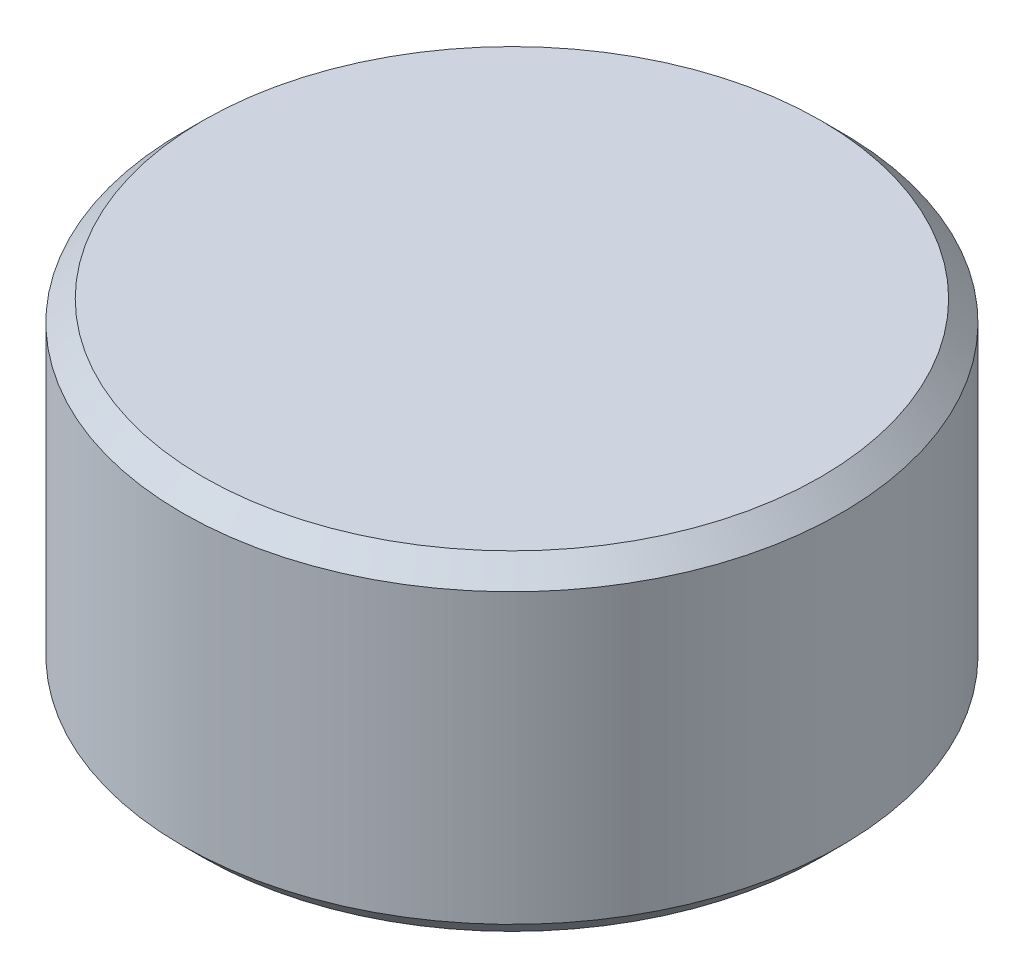
ISO-10303-21;
HEADER;
FILE_DESCRIPTION(('STEP AP214'),'2;1');
FILE_NAME('part.step','',(''),(''),'','','');
FILE_SCHEMA(('AUTOMOTIVE_DESIGN { 1 0 10303 214 1 1 1 1 }'));
ENDSEC;
DATA;
#1=APPLICATION_CONTEXT('core data for automotive mechanical design processes');
#2=APPLICATION_PROTOCOL_DEFINITION('international standard','automotive_design',2000,#1);
#3=PRODUCT_CONTEXT('',#1,'mechanical');
#4=PRODUCT('Part','Part','',(#3));
#5=PRODUCT_RELATED_PRODUCT_CATEGORY('part','',(#4));
#6=PRODUCT_DEFINITION_FORMATION('','',#4);
#7=PRODUCT_DEFINITION_CONTEXT('part definition',#1,'design');
#8=PRODUCT_DEFINITION('design','',#6,#7);
#9=PRODUCT_DEFINITION_SHAPE('','',#8);
#10=(LENGTH_UNIT() NAMED_UNIT(*) SI_UNIT(.MILLI.,.METRE.));
#11=(NAMED_UNIT(*) PLANE_ANGLE_UNIT() SI_UNIT($,.RADIAN.));
#12=(NAMED_UNIT(*) SI_UNIT($,.STERADIAN.) SOLID_ANGLE_UNIT());
#13=UNCERTAINTY_MEASURE_WITH_UNIT(LENGTH_MEASURE(1.E-05),#10,'distance_accuracy_value','');
#14=(GEOMETRIC_REPRESENTATION_CONTEXT(3) GLOBAL_UNCERTAINTY_ASSIGNED_CONTEXT((#13)) GLOBAL_UNIT_ASSIGNED_CONTEXT((#10,
#11,#12)) REPRESENTATION_CONTEXT('',''));
#15=CARTESIAN_POINT('',(0.,0.,0.));
#16=DIRECTION('',(0.,0.,1.));
#17=DIRECTION('',(1.,0.,0.));
#18=AXIS2_PLACEMENT_3D('',#15,#16,#17);
#19=CARTESIAN_POINT('',(0.,0.79375,0.));
#20=DIRECTION('',(0.,-1.,0.));
#21=DIRECTION('',(0.,0.,-1.));
#22=AXIS2_PLACEMENT_3D('',#19,#20,#21);
#23=CYLINDRICAL_SURFACE('',#22,1.5875);
#24=CARTESIAN_POINT('',(0.,-0.693749999999999,0.));
#25=DIRECTION('',(0.,1.,0.));
#26=DIRECTION('',(0.,0.,1.));
#27=AXIS2_PLACEMENT_3D('',#24,#25,#26);
#28=CIRCLE('',#27,1.5875);
#29=CARTESIAN_POINT('',(0.,-0.693749999999999,1.5875));
#30=VERTEX_POINT('',#29);
#31=EDGE_CURVE('E57',#30,#30,#28,.T.);
#32=ORIENTED_EDGE('',*,*,#31,.T.);
#33=EDGE_LOOP('',(#32));
#34=FACE_BOUND('',#33,.T.);
#35=CARTESIAN_POINT('',(0.,0.69375,0.));
#36=DIRECTION('',(0.,1.,0.));
#37=DIRECTION('',(0.,0.,1.));
#38=AXIS2_PLACEMENT_3D('',#35,#36,#37);
#39=CIRCLE('',#38,1.5875);
#40=CARTESIAN_POINT('',(0.,0.69375,1.5875));
#41=VERTEX_POINT('',#40);
#42=EDGE_CURVE('E62',#41,#41,#39,.F.);
#43=ORIENTED_EDGE('',*,*,#42,.T.);
#44=EDGE_LOOP('',(#43));
#45=FACE_BOUND('',#44,.T.);
#46=ADVANCED_FACE('F43',(#34,#45),#23,.T.);
#47=CARTESIAN_POINT('',(0.,0.79375,0.));
#48=DIRECTION('',(0.,1.,0.));
#49=DIRECTION('',(0.,0.,1.));
#50=AXIS2_PLACEMENT_3D('',#47,#48,#49);
#51=PLANE('',#50);
#52=CARTESIAN_POINT('',(0.,0.79375,0.));
#53=DIRECTION('',(0.,1.,0.));
#54=DIRECTION('',(0.,0.,1.));
#55=AXIS2_PLACEMENT_3D('',#52,#53,#54);
#56=CIRCLE('',#55,1.4875);
#57=CARTESIAN_POINT('',(0.,0.79375,1.4875));
#58=VERTEX_POINT('',#57);
#59=EDGE_CURVE('E10',#58,#58,#56,.T.);
#60=ORIENTED_EDGE('',*,*,#59,.T.);
#61=EDGE_LOOP('',(#60));
#62=FACE_BOUND('',#61,.T.);
#63=ADVANCED_FACE('F79',(#62),#51,.T.);
#64=CARTESIAN_POINT('',(0.,-0.79375,0.));
#65=DIRECTION('',(0.,1.,0.));
#66=DIRECTION('',(0.,0.,1.));
#67=AXIS2_PLACEMENT_3D('',#64,#65,#66);
#68=PLANE('',#67);
#69=CARTESIAN_POINT('',(0.,-0.79375,0.));
#70=DIRECTION('',(0.,1.,0.));
#71=DIRECTION('',(0.,0.,1.));
#72=AXIS2_PLACEMENT_3D('',#69,#70,#71);
#73=CIRCLE('',#72,1.4875);
#74=CARTESIAN_POINT('',(0.,-0.79375,1.4875));
#75=VERTEX_POINT('',#74);
#76=EDGE_CURVE('E52',#75,#75,#73,.F.);
#77=ORIENTED_EDGE('',*,*,#76,.T.);
#78=EDGE_LOOP('',(#77));
#79=FACE_BOUND('',#78,.T.);
#80=ADVANCED_FACE('F76',(#79),#68,.F.);
#81=CARTESIAN_POINT('',(0.,-0.693749999999999,0.));
#82=DIRECTION('',(0.,1.,0.));
#83=DIRECTION('',(0.,0.,1.));
#84=AXIS2_PLACEMENT_3D('',#81,#82,#83);
#85=CONICAL_SURFACE('',#84,1.5875,0.78539816339745);
#86=ORIENTED_EDGE('',*,*,#76,.F.);
#87=EDGE_LOOP('',(#86));
#88=FACE_BOUND('',#87,.T.);
#89=ORIENTED_EDGE('',*,*,#31,.F.);
#90=EDGE_LOOP('',(#89));
#91=FACE_BOUND('',#90,.T.);
#92=ADVANCED_FACE('F72',(#88,#91),#85,.T.);
#93=CARTESIAN_POINT('',(0.,0.79375,0.));
#94=DIRECTION('',(0.,-1.,0.));
#95=DIRECTION('',(0.,0.,-1.));
#96=AXIS2_PLACEMENT_3D('',#93,#94,#95);
#97=CONICAL_SURFACE('',#96,1.4875,0.785398163397449);
#98=ORIENTED_EDGE('',*,*,#42,.F.);
#99=EDGE_LOOP('',(#98));
#100=FACE_BOUND('',#99,.T.);
#101=ORIENTED_EDGE('',*,*,#59,.F.);
#102=EDGE_LOOP('',(#101));
#103=FACE_BOUND('',#102,.T.);
#104=ADVANCED_FACE('F46',(#100,#103),#97,.T.);
#105=CLOSED_SHELL('',(#46,#63,#80,#92,#104));
#106=MANIFOLD_SOLID_BREP('B2',#105);
#107=ADVANCED_BREP_SHAPE_REPRESENTATION('',(#18,#106),#14);
#108=SHAPE_DEFINITION_REPRESENTATION(#9,#107);
ENDSEC;
END-ISO-10303-21;
